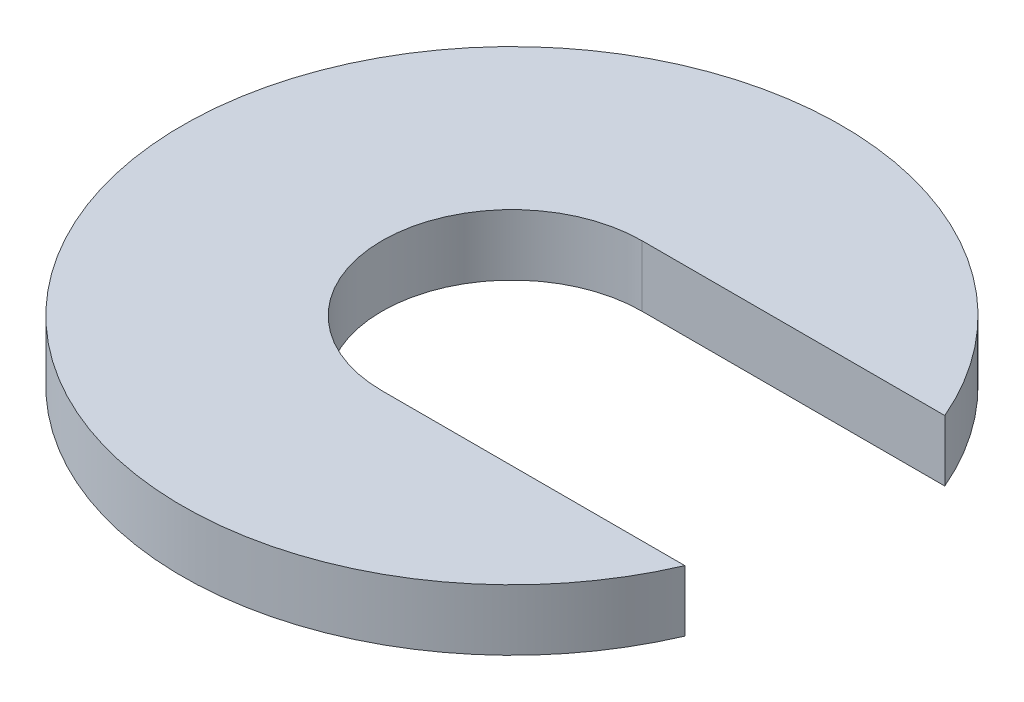
ISO-10303-21;
HEADER;
FILE_DESCRIPTION(('STEP AP214'),'2;1');
FILE_NAME('part.step','',(''),(''),'','','');
FILE_SCHEMA(('AUTOMOTIVE_DESIGN { 1 0 10303 214 1 1 1 1 }'));
ENDSEC;
DATA;
#1=APPLICATION_CONTEXT('core data for automotive mechanical design processes');
#2=APPLICATION_PROTOCOL_DEFINITION('international standard','automotive_design',2000,#1);
#3=PRODUCT_CONTEXT('',#1,'mechanical');
#4=PRODUCT('Part','Part','',(#3));
#5=PRODUCT_RELATED_PRODUCT_CATEGORY('part','',(#4));
#6=PRODUCT_DEFINITION_FORMATION('','',#4);
#7=PRODUCT_DEFINITION_CONTEXT('part definition',#1,'design');
#8=PRODUCT_DEFINITION('design','',#6,#7);
#9=PRODUCT_DEFINITION_SHAPE('','',#8);
#10=(LENGTH_UNIT() NAMED_UNIT(*) SI_UNIT(.MILLI.,.METRE.));
#11=(NAMED_UNIT(*) PLANE_ANGLE_UNIT() SI_UNIT($,.RADIAN.));
#12=(NAMED_UNIT(*) SI_UNIT($,.STERADIAN.) SOLID_ANGLE_UNIT());
#13=UNCERTAINTY_MEASURE_WITH_UNIT(LENGTH_MEASURE(1.E-05),#10,'distance_accuracy_value','');
#14=(GEOMETRIC_REPRESENTATION_CONTEXT(3) GLOBAL_UNCERTAINTY_ASSIGNED_CONTEXT((#13)) GLOBAL_UNIT_ASSIGNED_CONTEXT((#10,
#11,#12)) REPRESENTATION_CONTEXT('',''));
#15=CARTESIAN_POINT('',(0.,0.,0.));
#16=DIRECTION('',(0.,0.,1.));
#17=DIRECTION('',(1.,0.,0.));
#18=AXIS2_PLACEMENT_3D('',#15,#16,#17);
#19=CARTESIAN_POINT('',(0.,13.9,-29.575));
#20=DIRECTION('',(0.,0.,-1.));
#21=DIRECTION('',(-1.,0.,0.));
#22=AXIS2_PLACEMENT_3D('',#19,#20,#21);
#23=PLANE('',#22);
#24=DIRECTION('',(1.,0.,0.));
#25=VECTOR('',#24,1.);
#26=CARTESIAN_POINT('',(0.,0.,-29.575));
#27=LINE('',#26,#25);
#28=CARTESIAN_POINT('',(0.,0.,-29.575));
#29=VERTEX_POINT('',#28);
#30=CARTESIAN_POINT('',(68.9225607112794,0.,-29.575));
#31=VERTEX_POINT('',#30);
#32=EDGE_CURVE('E105',#29,#31,#27,.T.);
#33=ORIENTED_EDGE('',*,*,#32,.T.);
#34=DIRECTION('',(0.,-1.,0.));
#35=VECTOR('',#34,1.);
#36=CARTESIAN_POINT('',(68.9225607112794,13.9,-29.575));
#37=LINE('',#36,#35);
#38=CARTESIAN_POINT('',(68.9225607112794,13.9,-29.575));
#39=VERTEX_POINT('',#38);
#40=EDGE_CURVE('E13',#39,#31,#37,.T.);
#41=ORIENTED_EDGE('',*,*,#40,.F.);
#42=DIRECTION('',(1.,0.,0.));
#43=VECTOR('',#42,1.);
#44=CARTESIAN_POINT('',(0.,13.9,-29.575));
#45=LINE('',#44,#43);
#46=CARTESIAN_POINT('',(0.,13.9,-29.575));
#47=VERTEX_POINT('',#46);
#48=EDGE_CURVE('E91',#47,#39,#45,.T.);
#49=ORIENTED_EDGE('',*,*,#48,.F.);
#50=DIRECTION('',(0.,-1.,0.));
#51=VECTOR('',#50,1.);
#52=CARTESIAN_POINT('',(0.,13.9,-29.575));
#53=LINE('',#52,#51);
#54=EDGE_CURVE('E58',#47,#29,#53,.T.);
#55=ORIENTED_EDGE('',*,*,#54,.T.);
#56=EDGE_LOOP('',(#33,#41,#49,#55));
#57=FACE_BOUND('',#56,.T.);
#58=ADVANCED_FACE('F42',(#57),#23,.F.);
#59=CARTESIAN_POINT('',(1.11022302462516E-13,13.9,-1.11022302462516E-13));
#60=DIRECTION('',(0.,-1.,0.));
#61=DIRECTION('',(0.,0.,-1.));
#62=AXIS2_PLACEMENT_3D('',#59,#60,#61);
#63=CYLINDRICAL_SURFACE('',#62,75.);
#64=CARTESIAN_POINT('',(0.,0.,0.));
#65=DIRECTION('',(0.,1.,0.));
#66=DIRECTION('',(0.,0.,1.));
#67=AXIS2_PLACEMENT_3D('',#64,#65,#66);
#68=CIRCLE('',#67,75.);
#69=CARTESIAN_POINT('',(68.9225607112795,0.,29.575));
#70=VERTEX_POINT('',#69);
#71=EDGE_CURVE('E96',#31,#70,#68,.T.);
#72=ORIENTED_EDGE('',*,*,#71,.T.);
#73=DIRECTION('',(0.,-1.,0.));
#74=VECTOR('',#73,1.);
#75=CARTESIAN_POINT('',(68.9225607112795,13.9,29.575));
#76=LINE('',#75,#74);
#77=CARTESIAN_POINT('',(68.9225607112795,13.9,29.575));
#78=VERTEX_POINT('',#77);
#79=EDGE_CURVE('E50',#78,#70,#76,.T.);
#80=ORIENTED_EDGE('',*,*,#79,.F.);
#81=CARTESIAN_POINT('',(1.11022302462516E-13,13.9,-1.11022302462516E-13));
#82=DIRECTION('',(0.,1.,0.));
#83=DIRECTION('',(0.,0.,1.));
#84=AXIS2_PLACEMENT_3D('',#81,#82,#83);
#85=CIRCLE('',#84,75.);
#86=EDGE_CURVE('E83',#39,#78,#85,.T.);
#87=ORIENTED_EDGE('',*,*,#86,.F.);
#88=ORIENTED_EDGE('',*,*,#40,.T.);
#89=EDGE_LOOP('',(#72,#80,#87,#88));
#90=FACE_BOUND('',#89,.T.);
#91=ADVANCED_FACE('F95',(#90),#63,.T.);
#92=CARTESIAN_POINT('',(1.11022302462516E-13,13.9000000000001,29.575));
#93=DIRECTION('',(0.,0.,-1.));
#94=DIRECTION('',(-1.,0.,0.));
#95=AXIS2_PLACEMENT_3D('',#92,#93,#94);
#96=PLANE('',#95);
#97=DIRECTION('',(1.,0.,0.));
#98=VECTOR('',#97,1.);
#99=CARTESIAN_POINT('',(0.,1.11022302462516E-13,29.575));
#100=LINE('',#99,#98);
#101=CARTESIAN_POINT('',(0.,1.11022302462516E-13,29.575));
#102=VERTEX_POINT('',#101);
#103=EDGE_CURVE('E108',#102,#70,#100,.T.);
#104=ORIENTED_EDGE('',*,*,#103,.F.);
#105=DIRECTION('',(0.,-1.,0.));
#106=VECTOR('',#105,1.);
#107=CARTESIAN_POINT('',(1.11022302462516E-13,13.9000000000001,29.575));
#108=LINE('',#107,#106);
#109=CARTESIAN_POINT('',(1.11022302462516E-13,13.9000000000001,29.575));
#110=VERTEX_POINT('',#109);
#111=EDGE_CURVE('E72',#110,#102,#108,.T.);
#112=ORIENTED_EDGE('',*,*,#111,.F.);
#113=DIRECTION('',(1.,0.,0.));
#114=VECTOR('',#113,1.);
#115=CARTESIAN_POINT('',(1.11022302462516E-13,13.9000000000001,29.575));
#116=LINE('',#115,#114);
#117=EDGE_CURVE('E90',#110,#78,#116,.T.);
#118=ORIENTED_EDGE('',*,*,#117,.T.);
#119=ORIENTED_EDGE('',*,*,#79,.T.);
#120=EDGE_LOOP('',(#104,#112,#118,#119));
#121=FACE_BOUND('',#120,.T.);
#122=ADVANCED_FACE('F99',(#121),#96,.T.);
#123=CARTESIAN_POINT('',(1.11022302462516E-13,13.9,-1.11022302462516E-13));
#124=DIRECTION('',(0.,-1.,0.));
#125=DIRECTION('',(0.,0.,-1.));
#126=AXIS2_PLACEMENT_3D('',#123,#124,#125);
#127=CYLINDRICAL_SURFACE('',#126,29.575);
#128=CARTESIAN_POINT('',(0.,0.,0.));
#129=DIRECTION('',(0.,1.,0.));
#130=DIRECTION('',(0.,0.,1.));
#131=AXIS2_PLACEMENT_3D('',#128,#129,#130);
#132=CIRCLE('',#131,29.575);
#133=EDGE_CURVE('E110',#29,#102,#132,.T.);
#134=ORIENTED_EDGE('',*,*,#133,.F.);
#135=ORIENTED_EDGE('',*,*,#54,.F.);
#136=CARTESIAN_POINT('',(1.11022302462516E-13,13.9,-1.11022302462516E-13));
#137=DIRECTION('',(0.,1.,0.));
#138=DIRECTION('',(0.,0.,1.));
#139=AXIS2_PLACEMENT_3D('',#136,#137,#138);
#140=CIRCLE('',#139,29.575);
#141=EDGE_CURVE('E100',#47,#110,#140,.T.);
#142=ORIENTED_EDGE('',*,*,#141,.T.);
#143=ORIENTED_EDGE('',*,*,#111,.T.);
#144=EDGE_LOOP('',(#134,#135,#142,#143));
#145=FACE_BOUND('',#144,.T.);
#146=ADVANCED_FACE('F116',(#145),#127,.F.);
#147=CARTESIAN_POINT('',(1.11022302462516E-13,13.9,-1.11022302462516E-13));
#148=DIRECTION('',(0.,1.,0.));
#149=DIRECTION('',(0.,0.,1.));
#150=AXIS2_PLACEMENT_3D('',#147,#148,#149);
#151=PLANE('',#150);
#152=ORIENTED_EDGE('',*,*,#48,.T.);
#153=ORIENTED_EDGE('',*,*,#86,.T.);
#154=ORIENTED_EDGE('',*,*,#117,.F.);
#155=ORIENTED_EDGE('',*,*,#141,.F.);
#156=EDGE_LOOP('',(#152,#153,#154,#155));
#157=FACE_BOUND('',#156,.T.);
#158=ADVANCED_FACE('F87',(#157),#151,.T.);
#159=CARTESIAN_POINT('',(0.,0.,0.));
#160=DIRECTION('',(0.,1.,0.));
#161=DIRECTION('',(0.,0.,1.));
#162=AXIS2_PLACEMENT_3D('',#159,#160,#161);
#163=PLANE('',#162);
#164=ORIENTED_EDGE('',*,*,#32,.F.);
#165=ORIENTED_EDGE('',*,*,#133,.T.);
#166=ORIENTED_EDGE('',*,*,#103,.T.);
#167=ORIENTED_EDGE('',*,*,#71,.F.);
#168=EDGE_LOOP('',(#164,#165,#166,#167));
#169=FACE_BOUND('',#168,.T.);
#170=ADVANCED_FACE('F115',(#169),#163,.F.);
#171=CLOSED_SHELL('',(#58,#91,#122,#146,#158,#170));
#172=MANIFOLD_SOLID_BREP('B2',#171);
#173=ADVANCED_BREP_SHAPE_REPRESENTATION('',(#18,#172),#14);
#174=SHAPE_DEFINITION_REPRESENTATION(#9,#173);
ENDSEC;
END-ISO-10303-21;
